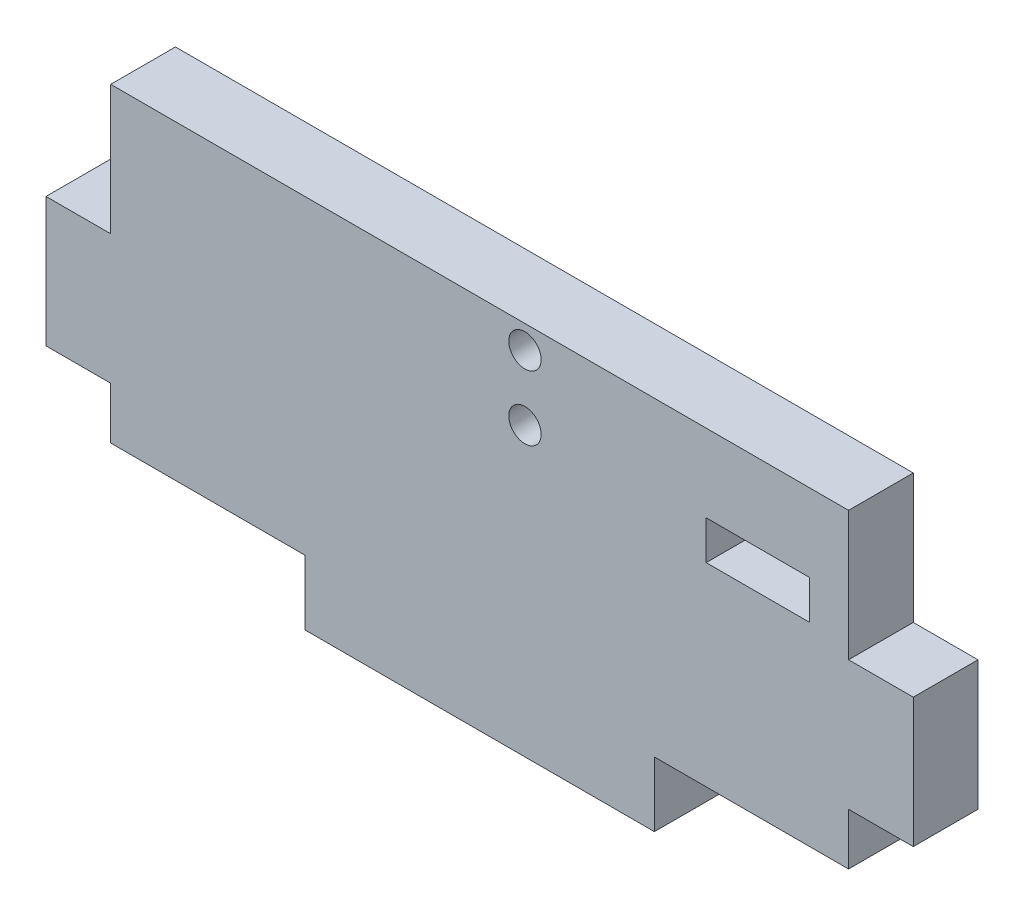
ISO-10303-21;
HEADER;
FILE_DESCRIPTION(('STEP AP214'),'2;1');
FILE_NAME('part.step','',(''),(''),'','','');
FILE_SCHEMA(('AUTOMOTIVE_DESIGN { 1 0 10303 214 1 1 1 1 }'));
ENDSEC;
DATA;
#1=APPLICATION_CONTEXT('core data for automotive mechanical design processes');
#2=APPLICATION_PROTOCOL_DEFINITION('international standard','automotive_design',2000,#1);
#3=PRODUCT_CONTEXT('',#1,'mechanical');
#4=PRODUCT('Part','Part','',(#3));
#5=PRODUCT_RELATED_PRODUCT_CATEGORY('part','',(#4));
#6=PRODUCT_DEFINITION_FORMATION('','',#4);
#7=PRODUCT_DEFINITION_CONTEXT('part definition',#1,'design');
#8=PRODUCT_DEFINITION('design','',#6,#7);
#9=PRODUCT_DEFINITION_SHAPE('','',#8);
#10=(LENGTH_UNIT() NAMED_UNIT(*) SI_UNIT(.MILLI.,.METRE.));
#11=(NAMED_UNIT(*) PLANE_ANGLE_UNIT() SI_UNIT($,.RADIAN.));
#12=(NAMED_UNIT(*) SI_UNIT($,.STERADIAN.) SOLID_ANGLE_UNIT());
#13=UNCERTAINTY_MEASURE_WITH_UNIT(LENGTH_MEASURE(1.E-05),#10,'distance_accuracy_value','');
#14=(GEOMETRIC_REPRESENTATION_CONTEXT(3) GLOBAL_UNCERTAINTY_ASSIGNED_CONTEXT((#13)) GLOBAL_UNIT_ASSIGNED_CONTEXT((#10,
#11,#12)) REPRESENTATION_CONTEXT('',''));
#15=CARTESIAN_POINT('',(0.,0.,0.));
#16=DIRECTION('',(0.,0.,1.));
#17=DIRECTION('',(1.,0.,0.));
#18=AXIS2_PLACEMENT_3D('',#15,#16,#17);
#19=CARTESIAN_POINT('',(0.,22.86,-26.3054205404025));
#20=DIRECTION('',(0.,-1.,0.));
#21=DIRECTION('',(1.,0.,0.));
#22=AXIS2_PLACEMENT_3D('',#19,#20,#21);
#23=PLANE('',#22);
#24=DIRECTION('',(-1.,0.,0.));
#25=VECTOR('',#24,1.);
#26=CARTESIAN_POINT('',(0.,22.86,-32.6554205404025));
#27=LINE('',#26,#25);
#28=CARTESIAN_POINT('',(68.58,22.86,-32.6554205404025));
#29=VERTEX_POINT('',#28);
#30=CARTESIAN_POINT('',(58.42,22.86,-32.6554205404025));
#31=VERTEX_POINT('',#30);
#32=EDGE_CURVE('E246',#29,#31,#27,.T.);
#33=ORIENTED_EDGE('',*,*,#32,.F.);
#34=DIRECTION('',(0.,0.,-1.));
#35=VECTOR('',#34,1.);
#36=CARTESIAN_POINT('',(68.58,22.86,-26.3054205404025));
#37=LINE('',#36,#35);
#38=CARTESIAN_POINT('',(68.58,22.86,-26.3054205404025));
#39=VERTEX_POINT('',#38);
#40=EDGE_CURVE('E11',#39,#29,#37,.T.);
#41=ORIENTED_EDGE('',*,*,#40,.F.);
#42=DIRECTION('',(-1.,0.,0.));
#43=VECTOR('',#42,1.);
#44=CARTESIAN_POINT('',(0.,22.86,-26.3054205404025));
#45=LINE('',#44,#43);
#46=CARTESIAN_POINT('',(58.42,22.86,-26.3054205404025));
#47=VERTEX_POINT('',#46);
#48=EDGE_CURVE('E195',#39,#47,#45,.T.);
#49=ORIENTED_EDGE('',*,*,#48,.T.);
#50=DIRECTION('',(0.,0.,-1.));
#51=VECTOR('',#50,1.);
#52=CARTESIAN_POINT('',(58.42,22.86,-26.3054205404025));
#53=LINE('',#52,#51);
#54=EDGE_CURVE('E192',#47,#31,#53,.T.);
#55=ORIENTED_EDGE('',*,*,#54,.T.);
#56=EDGE_LOOP('',(#33,#41,#49,#55));
#57=FACE_BOUND('',#56,.T.);
#58=ADVANCED_FACE('F32',(#57),#23,.T.);
#59=CARTESIAN_POINT('',(68.58,0.,-26.3054205404025));
#60=DIRECTION('',(1.,0.,0.));
#61=DIRECTION('',(0.,0.,-1.));
#62=AXIS2_PLACEMENT_3D('',#59,#60,#61);
#63=PLANE('',#62);
#64=DIRECTION('',(0.,-1.,0.));
#65=VECTOR('',#64,1.);
#66=CARTESIAN_POINT('',(68.58,0.,-32.6554205404025));
#67=LINE('',#66,#65);
#68=CARTESIAN_POINT('',(68.58,19.05,-32.6554205404025));
#69=VERTEX_POINT('',#68);
#70=EDGE_CURVE('E252',#29,#69,#67,.T.);
#71=ORIENTED_EDGE('',*,*,#70,.T.);
#72=DIRECTION('',(0.,0.,-1.));
#73=VECTOR('',#72,1.);
#74=CARTESIAN_POINT('',(68.58,19.05,-26.3054205404025));
#75=LINE('',#74,#73);
#76=CARTESIAN_POINT('',(68.58,19.05,-26.3054205404025));
#77=VERTEX_POINT('',#76);
#78=EDGE_CURVE('E42',#77,#69,#75,.T.);
#79=ORIENTED_EDGE('',*,*,#78,.F.);
#80=DIRECTION('',(0.,-1.,0.));
#81=VECTOR('',#80,1.);
#82=CARTESIAN_POINT('',(68.58,0.,-26.3054205404025));
#83=LINE('',#82,#81);
#84=EDGE_CURVE('E184',#39,#77,#83,.T.);
#85=ORIENTED_EDGE('',*,*,#84,.F.);
#86=ORIENTED_EDGE('',*,*,#40,.T.);
#87=EDGE_LOOP('',(#71,#79,#85,#86));
#88=FACE_BOUND('',#87,.T.);
#89=ADVANCED_FACE('F369',(#88),#63,.F.);
#90=CARTESIAN_POINT('',(0.,19.05,-26.3054205404025));
#91=DIRECTION('',(0.,-1.,0.));
#92=DIRECTION('',(0.,0.,-1.));
#93=AXIS2_PLACEMENT_3D('',#90,#91,#92);
#94=PLANE('',#93);
#95=DIRECTION('',(-1.,0.,0.));
#96=VECTOR('',#95,1.);
#97=CARTESIAN_POINT('',(0.,19.05,-32.6554205404025));
#98=LINE('',#97,#96);
#99=CARTESIAN_POINT('',(58.42,19.05,-32.6554205404025));
#100=VERTEX_POINT('',#99);
#101=EDGE_CURVE('E115',#69,#100,#98,.T.);
#102=ORIENTED_EDGE('',*,*,#101,.T.);
#103=DIRECTION('',(0.,0.,-1.));
#104=VECTOR('',#103,1.);
#105=CARTESIAN_POINT('',(58.42,19.05,-26.3054205404025));
#106=LINE('',#105,#104);
#107=CARTESIAN_POINT('',(58.42,19.05,-26.3054205404025));
#108=VERTEX_POINT('',#107);
#109=EDGE_CURVE('E188',#108,#100,#106,.T.);
#110=ORIENTED_EDGE('',*,*,#109,.F.);
#111=DIRECTION('',(-1.,0.,0.));
#112=VECTOR('',#111,1.);
#113=CARTESIAN_POINT('',(0.,19.05,-26.3054205404025));
#114=LINE('',#113,#112);
#115=EDGE_CURVE('E178',#77,#108,#114,.T.);
#116=ORIENTED_EDGE('',*,*,#115,.F.);
#117=ORIENTED_EDGE('',*,*,#78,.T.);
#118=EDGE_LOOP('',(#102,#110,#116,#117));
#119=FACE_BOUND('',#118,.T.);
#120=ADVANCED_FACE('F189',(#119),#94,.F.);
#121=CARTESIAN_POINT('',(0.,0.,-26.3054205404025));
#122=DIRECTION('',(1.,0.,0.));
#123=DIRECTION('',(0.,0.,-1.));
#124=AXIS2_PLACEMENT_3D('',#121,#122,#123);
#125=PLANE('',#124);
#126=DIRECTION('',(0.,-1.,0.));
#127=VECTOR('',#126,1.);
#128=CARTESIAN_POINT('',(0.,0.,-32.6554205404025));
#129=LINE('',#128,#127);
#130=CARTESIAN_POINT('',(0.,30.48,-32.6554205404025));
#131=VERTEX_POINT('',#130);
#132=CARTESIAN_POINT('',(0.,17.78,-32.6554205404025));
#133=VERTEX_POINT('',#132);
#134=EDGE_CURVE('E208',#131,#133,#129,.T.);
#135=ORIENTED_EDGE('',*,*,#134,.T.);
#136=DIRECTION('',(0.,0.,-1.));
#137=VECTOR('',#136,1.);
#138=CARTESIAN_POINT('',(0.,17.78,-26.3054205404025));
#139=LINE('',#138,#137);
#140=CARTESIAN_POINT('',(0.,17.78,-26.3054205404025));
#141=VERTEX_POINT('',#140);
#142=EDGE_CURVE('E257',#141,#133,#139,.T.);
#143=ORIENTED_EDGE('',*,*,#142,.F.);
#144=DIRECTION('',(0.,-1.,0.));
#145=VECTOR('',#144,1.);
#146=CARTESIAN_POINT('',(0.,0.,-26.3054205404025));
#147=LINE('',#146,#145);
#148=CARTESIAN_POINT('',(0.,30.48,-26.3054205404025));
#149=VERTEX_POINT('',#148);
#150=EDGE_CURVE('E297',#149,#141,#147,.T.);
#151=ORIENTED_EDGE('',*,*,#150,.F.);
#152=DIRECTION('',(0.,0.,-1.));
#153=VECTOR('',#152,1.);
#154=CARTESIAN_POINT('',(0.,30.48,-26.3054205404025));
#155=LINE('',#154,#153);
#156=EDGE_CURVE('E36',#149,#131,#155,.T.);
#157=ORIENTED_EDGE('',*,*,#156,.T.);
#158=EDGE_LOOP('',(#135,#143,#151,#157));
#159=FACE_BOUND('',#158,.T.);
#160=ADVANCED_FACE('F295',(#159),#125,.F.);
#161=CARTESIAN_POINT('',(0.,17.78,-26.3054205404025));
#162=DIRECTION('',(0.,1.,0.));
#163=DIRECTION('',(0.,0.,1.));
#164=AXIS2_PLACEMENT_3D('',#161,#162,#163);
#165=PLANE('',#164);
#166=DIRECTION('',(1.,0.,0.));
#167=VECTOR('',#166,1.);
#168=CARTESIAN_POINT('',(0.,17.78,-32.6554205404025));
#169=LINE('',#168,#167);
#170=CARTESIAN_POINT('',(-6.35,17.78,-32.6554205404025));
#171=VERTEX_POINT('',#170);
#172=EDGE_CURVE('E243',#171,#133,#169,.T.);
#173=ORIENTED_EDGE('',*,*,#172,.F.);
#174=DIRECTION('',(0.,0.,-1.));
#175=VECTOR('',#174,1.);
#176=CARTESIAN_POINT('',(-6.35,17.78,-26.3054205404025));
#177=LINE('',#176,#175);
#178=CARTESIAN_POINT('',(-6.35,17.78,-26.3054205404025));
#179=VERTEX_POINT('',#178);
#180=EDGE_CURVE('E259',#179,#171,#177,.T.);
#181=ORIENTED_EDGE('',*,*,#180,.F.);
#182=DIRECTION('',(1.,0.,0.));
#183=VECTOR('',#182,1.);
#184=CARTESIAN_POINT('',(0.,17.78,-26.3054205404025));
#185=LINE('',#184,#183);
#186=EDGE_CURVE('E197',#179,#141,#185,.T.);
#187=ORIENTED_EDGE('',*,*,#186,.T.);
#188=ORIENTED_EDGE('',*,*,#142,.T.);
#189=EDGE_LOOP('',(#173,#181,#187,#188));
#190=FACE_BOUND('',#189,.T.);
#191=ADVANCED_FACE('F305',(#190),#165,.T.);
#192=CARTESIAN_POINT('',(-6.35,0.,-26.3054205404025));
#193=DIRECTION('',(-1.,0.,0.));
#194=DIRECTION('',(0.,0.,1.));
#195=AXIS2_PLACEMENT_3D('',#192,#193,#194);
#196=PLANE('',#195);
#197=DIRECTION('',(0.,1.,0.));
#198=VECTOR('',#197,1.);
#199=CARTESIAN_POINT('',(-6.35,0.,-32.6554205404025));
#200=LINE('',#199,#198);
#201=CARTESIAN_POINT('',(-6.35,5.07999999999999,-32.6554205404025));
#202=VERTEX_POINT('',#201);
#203=EDGE_CURVE('E240',#202,#171,#200,.T.);
#204=ORIENTED_EDGE('',*,*,#203,.F.);
#205=DIRECTION('',(0.,0.,-1.));
#206=VECTOR('',#205,1.);
#207=CARTESIAN_POINT('',(-6.35,5.07999999999999,-26.3054205404025));
#208=LINE('',#207,#206);
#209=CARTESIAN_POINT('',(-6.35,5.07999999999999,-26.3054205404025));
#210=VERTEX_POINT('',#209);
#211=EDGE_CURVE('E261',#210,#202,#208,.T.);
#212=ORIENTED_EDGE('',*,*,#211,.F.);
#213=DIRECTION('',(0.,1.,0.));
#214=VECTOR('',#213,1.);
#215=CARTESIAN_POINT('',(-6.35,0.,-26.3054205404025));
#216=LINE('',#215,#214);
#217=EDGE_CURVE('E310',#210,#179,#216,.T.);
#218=ORIENTED_EDGE('',*,*,#217,.T.);
#219=ORIENTED_EDGE('',*,*,#180,.T.);
#220=EDGE_LOOP('',(#204,#212,#218,#219));
#221=FACE_BOUND('',#220,.T.);
#222=ADVANCED_FACE('F380',(#221),#196,.T.);
#223=CARTESIAN_POINT('',(0.,5.07999999999999,-26.3054205404025));
#224=DIRECTION('',(0.,1.,0.));
#225=DIRECTION('',(-1.,0.,0.));
#226=AXIS2_PLACEMENT_3D('',#223,#224,#225);
#227=PLANE('',#226);
#228=DIRECTION('',(1.,0.,0.));
#229=VECTOR('',#228,1.);
#230=CARTESIAN_POINT('',(0.,5.07999999999999,-32.6554205404025));
#231=LINE('',#230,#229);
#232=CARTESIAN_POINT('',(0.,5.07999999999999,-32.6554205404025));
#233=VERTEX_POINT('',#232);
#234=EDGE_CURVE('E238',#202,#233,#231,.T.);
#235=ORIENTED_EDGE('',*,*,#234,.T.);
#236=DIRECTION('',(0.,0.,-1.));
#237=VECTOR('',#236,1.);
#238=CARTESIAN_POINT('',(0.,5.07999999999999,-26.3054205404025));
#239=LINE('',#238,#237);
#240=CARTESIAN_POINT('',(0.,5.07999999999999,-26.3054205404025));
#241=VERTEX_POINT('',#240);
#242=EDGE_CURVE('E263',#241,#233,#239,.T.);
#243=ORIENTED_EDGE('',*,*,#242,.F.);
#244=DIRECTION('',(1.,0.,0.));
#245=VECTOR('',#244,1.);
#246=CARTESIAN_POINT('',(0.,5.07999999999999,-26.3054205404025));
#247=LINE('',#246,#245);
#248=EDGE_CURVE('E311',#210,#241,#247,.T.);
#249=ORIENTED_EDGE('',*,*,#248,.F.);
#250=ORIENTED_EDGE('',*,*,#211,.T.);
#251=EDGE_LOOP('',(#235,#243,#249,#250));
#252=FACE_BOUND('',#251,.T.);
#253=ADVANCED_FACE('F383',(#252),#227,.F.);
#254=CARTESIAN_POINT('',(0.,0.,-32.6554205404025));
#255=VERTEX_POINT('',#254);
#256=EDGE_CURVE('E212',#233,#255,#129,.T.);
#257=ORIENTED_EDGE('',*,*,#256,.T.);
#258=DIRECTION('',(0.,0.,-1.));
#259=VECTOR('',#258,1.);
#260=CARTESIAN_POINT('',(0.,0.,-26.3054205404025));
#261=LINE('',#260,#259);
#262=CARTESIAN_POINT('',(0.,0.,-26.3054205404025));
#263=VERTEX_POINT('',#262);
#264=EDGE_CURVE('E266',#263,#255,#261,.T.);
#265=ORIENTED_EDGE('',*,*,#264,.F.);
#266=EDGE_CURVE('E315',#241,#263,#147,.T.);
#267=ORIENTED_EDGE('',*,*,#266,.F.);
#268=ORIENTED_EDGE('',*,*,#242,.T.);
#269=EDGE_LOOP('',(#257,#265,#267,#268));
#270=FACE_BOUND('',#269,.T.);
#271=ADVANCED_FACE('F387',(#270),#125,.F.);
#272=CARTESIAN_POINT('',(0.,0.,-26.3054205404025));
#273=DIRECTION('',(0.,-1.,0.));
#274=DIRECTION('',(0.,0.,-1.));
#275=AXIS2_PLACEMENT_3D('',#272,#273,#274);
#276=PLANE('',#275);
#277=DIRECTION('',(-1.,0.,0.));
#278=VECTOR('',#277,1.);
#279=CARTESIAN_POINT('',(0.,0.,-32.6554205404025));
#280=LINE('',#279,#278);
#281=CARTESIAN_POINT('',(19.05,0.,-32.6554205404025));
#282=VERTEX_POINT('',#281);
#283=EDGE_CURVE('E229',#282,#255,#280,.T.);
#284=ORIENTED_EDGE('',*,*,#283,.F.);
#285=DIRECTION('',(0.,0.,-1.));
#286=VECTOR('',#285,1.);
#287=CARTESIAN_POINT('',(19.05,0.,-26.3054205404025));
#288=LINE('',#287,#286);
#289=CARTESIAN_POINT('',(19.05,0.,-26.3054205404025));
#290=VERTEX_POINT('',#289);
#291=EDGE_CURVE('E268',#290,#282,#288,.T.);
#292=ORIENTED_EDGE('',*,*,#291,.F.);
#293=DIRECTION('',(-1.,0.,0.));
#294=VECTOR('',#293,1.);
#295=CARTESIAN_POINT('',(0.,0.,-26.3054205404025));
#296=LINE('',#295,#294);
#297=EDGE_CURVE('E318',#290,#263,#296,.T.);
#298=ORIENTED_EDGE('',*,*,#297,.T.);
#299=ORIENTED_EDGE('',*,*,#264,.T.);
#300=EDGE_LOOP('',(#284,#292,#298,#299));
#301=FACE_BOUND('',#300,.T.);
#302=ADVANCED_FACE('F391',(#301),#276,.T.);
#303=CARTESIAN_POINT('',(19.05,0.,-26.3054205404025));
#304=DIRECTION('',(1.,0.,0.));
#305=DIRECTION('',(0.,0.,-1.));
#306=AXIS2_PLACEMENT_3D('',#303,#304,#305);
#307=PLANE('',#306);
#308=DIRECTION('',(0.,-1.,0.));
#309=VECTOR('',#308,1.);
#310=CARTESIAN_POINT('',(19.05,0.,-32.6554205404025));
#311=LINE('',#310,#309);
#312=CARTESIAN_POINT('',(19.05,-6.35,-32.6554205404025));
#313=VERTEX_POINT('',#312);
#314=EDGE_CURVE('E235',#282,#313,#311,.T.);
#315=ORIENTED_EDGE('',*,*,#314,.T.);
#316=DIRECTION('',(0.,0.,-1.));
#317=VECTOR('',#316,1.);
#318=CARTESIAN_POINT('',(19.05,-6.35,-26.3054205404025));
#319=LINE('',#318,#317);
#320=CARTESIAN_POINT('',(19.05,-6.35,-26.3054205404025));
#321=VERTEX_POINT('',#320);
#322=EDGE_CURVE('E270',#321,#313,#319,.T.);
#323=ORIENTED_EDGE('',*,*,#322,.F.);
#324=DIRECTION('',(0.,-1.,0.));
#325=VECTOR('',#324,1.);
#326=CARTESIAN_POINT('',(19.05,0.,-26.3054205404025));
#327=LINE('',#326,#325);
#328=EDGE_CURVE('E316',#290,#321,#327,.T.);
#329=ORIENTED_EDGE('',*,*,#328,.F.);
#330=ORIENTED_EDGE('',*,*,#291,.T.);
#331=EDGE_LOOP('',(#315,#323,#329,#330));
#332=FACE_BOUND('',#331,.T.);
#333=ADVANCED_FACE('F395',(#332),#307,.F.);
#334=CARTESIAN_POINT('',(0.,-6.35,-26.3054205404025));
#335=DIRECTION('',(0.,-1.,0.));
#336=DIRECTION('',(0.,0.,-1.));
#337=AXIS2_PLACEMENT_3D('',#334,#335,#336);
#338=PLANE('',#337);
#339=DIRECTION('',(-1.,0.,0.));
#340=VECTOR('',#339,1.);
#341=CARTESIAN_POINT('',(0.,-6.35,-32.6554205404025));
#342=LINE('',#341,#340);
#343=CARTESIAN_POINT('',(53.34,-6.35,-32.6554205404025));
#344=VERTEX_POINT('',#343);
#345=EDGE_CURVE('E232',#344,#313,#342,.T.);
#346=ORIENTED_EDGE('',*,*,#345,.F.);
#347=DIRECTION('',(0.,0.,-1.));
#348=VECTOR('',#347,1.);
#349=CARTESIAN_POINT('',(53.34,-6.35,-26.3054205404025));
#350=LINE('',#349,#348);
#351=CARTESIAN_POINT('',(53.34,-6.35,-26.3054205404025));
#352=VERTEX_POINT('',#351);
#353=EDGE_CURVE('E272',#352,#344,#350,.T.);
#354=ORIENTED_EDGE('',*,*,#353,.F.);
#355=DIRECTION('',(-1.,0.,0.));
#356=VECTOR('',#355,1.);
#357=CARTESIAN_POINT('',(0.,-6.35,-26.3054205404025));
#358=LINE('',#357,#356);
#359=EDGE_CURVE('E319',#352,#321,#358,.T.);
#360=ORIENTED_EDGE('',*,*,#359,.T.);
#361=ORIENTED_EDGE('',*,*,#322,.T.);
#362=EDGE_LOOP('',(#346,#354,#360,#361));
#363=FACE_BOUND('',#362,.T.);
#364=ADVANCED_FACE('F400',(#363),#338,.T.);
#365=CARTESIAN_POINT('',(53.34,0.,-26.3054205404025));
#366=DIRECTION('',(1.,0.,0.));
#367=DIRECTION('',(0.,0.,-1.));
#368=AXIS2_PLACEMENT_3D('',#365,#366,#367);
#369=PLANE('',#368);
#370=DIRECTION('',(0.,-1.,0.));
#371=VECTOR('',#370,1.);
#372=CARTESIAN_POINT('',(53.34,0.,-32.6554205404025));
#373=LINE('',#372,#371);
#374=CARTESIAN_POINT('',(53.34,0.,-32.6554205404025));
#375=VERTEX_POINT('',#374);
#376=EDGE_CURVE('E228',#375,#344,#373,.T.);
#377=ORIENTED_EDGE('',*,*,#376,.F.);
#378=DIRECTION('',(0.,0.,-1.));
#379=VECTOR('',#378,1.);
#380=CARTESIAN_POINT('',(53.34,0.,-26.3054205404025));
#381=LINE('',#380,#379);
#382=CARTESIAN_POINT('',(53.34,0.,-26.3054205404025));
#383=VERTEX_POINT('',#382);
#384=EDGE_CURVE('E274',#383,#375,#381,.T.);
#385=ORIENTED_EDGE('',*,*,#384,.F.);
#386=DIRECTION('',(0.,-1.,0.));
#387=VECTOR('',#386,1.);
#388=CARTESIAN_POINT('',(53.34,0.,-26.3054205404025));
#389=LINE('',#388,#387);
#390=EDGE_CURVE('E322',#383,#352,#389,.T.);
#391=ORIENTED_EDGE('',*,*,#390,.T.);
#392=ORIENTED_EDGE('',*,*,#353,.T.);
#393=EDGE_LOOP('',(#377,#385,#391,#392));
#394=FACE_BOUND('',#393,.T.);
#395=ADVANCED_FACE('F404',(#394),#369,.T.);
#396=CARTESIAN_POINT('',(72.39,0.,-32.6554205404025));
#397=VERTEX_POINT('',#396);
#398=EDGE_CURVE('E225',#397,#375,#280,.T.);
#399=ORIENTED_EDGE('',*,*,#398,.F.);
#400=DIRECTION('',(0.,0.,-1.));
#401=VECTOR('',#400,1.);
#402=CARTESIAN_POINT('',(72.39,0.,-26.3054205404025));
#403=LINE('',#402,#401);
#404=CARTESIAN_POINT('',(72.39,0.,-26.3054205404025));
#405=VERTEX_POINT('',#404);
#406=EDGE_CURVE('E276',#405,#397,#403,.T.);
#407=ORIENTED_EDGE('',*,*,#406,.F.);
#408=EDGE_CURVE('E325',#405,#383,#296,.T.);
#409=ORIENTED_EDGE('',*,*,#408,.T.);
#410=ORIENTED_EDGE('',*,*,#384,.T.);
#411=EDGE_LOOP('',(#399,#407,#409,#410));
#412=FACE_BOUND('',#411,.T.);
#413=ADVANCED_FACE('F397',(#412),#276,.T.);
#414=CARTESIAN_POINT('',(72.39,0.,-26.3054205404025));
#415=DIRECTION('',(-1.,0.,0.));
#416=DIRECTION('',(0.,0.,1.));
#417=AXIS2_PLACEMENT_3D('',#414,#415,#416);
#418=PLANE('',#417);
#419=DIRECTION('',(0.,1.,0.));
#420=VECTOR('',#419,1.);
#421=CARTESIAN_POINT('',(72.39,0.,-32.6554205404025));
#422=LINE('',#421,#420);
#423=CARTESIAN_POINT('',(72.39,5.08,-32.6554205404025));
#424=VERTEX_POINT('',#423);
#425=EDGE_CURVE('E217',#397,#424,#422,.T.);
#426=ORIENTED_EDGE('',*,*,#425,.T.);
#427=DIRECTION('',(0.,0.,-1.));
#428=VECTOR('',#427,1.);
#429=CARTESIAN_POINT('',(72.39,5.08,-26.3054205404025));
#430=LINE('',#429,#428);
#431=CARTESIAN_POINT('',(72.39,5.08,-26.3054205404025));
#432=VERTEX_POINT('',#431);
#433=EDGE_CURVE('E278',#432,#424,#430,.T.);
#434=ORIENTED_EDGE('',*,*,#433,.F.);
#435=DIRECTION('',(0.,1.,0.));
#436=VECTOR('',#435,1.);
#437=CARTESIAN_POINT('',(72.39,0.,-26.3054205404025));
#438=LINE('',#437,#436);
#439=EDGE_CURVE('E328',#405,#432,#438,.T.);
#440=ORIENTED_EDGE('',*,*,#439,.F.);
#441=ORIENTED_EDGE('',*,*,#406,.T.);
#442=EDGE_LOOP('',(#426,#434,#440,#441));
#443=FACE_BOUND('',#442,.T.);
#444=ADVANCED_FACE('F409',(#443),#418,.F.);
#445=CARTESIAN_POINT('',(0.,5.08,-26.3054205404025));
#446=DIRECTION('',(0.,-1.,0.));
#447=DIRECTION('',(0.,0.,-1.));
#448=AXIS2_PLACEMENT_3D('',#445,#446,#447);
#449=PLANE('',#448);
#450=DIRECTION('',(-1.,0.,0.));
#451=VECTOR('',#450,1.);
#452=CARTESIAN_POINT('',(0.,5.08,-32.6554205404025));
#453=LINE('',#452,#451);
#454=CARTESIAN_POINT('',(78.74,5.08,-32.6554205404025));
#455=VERTEX_POINT('',#454);
#456=EDGE_CURVE('E222',#455,#424,#453,.T.);
#457=ORIENTED_EDGE('',*,*,#456,.F.);
#458=DIRECTION('',(0.,0.,-1.));
#459=VECTOR('',#458,1.);
#460=CARTESIAN_POINT('',(78.74,5.08,-26.3054205404025));
#461=LINE('',#460,#459);
#462=CARTESIAN_POINT('',(78.74,5.08,-26.3054205404025));
#463=VERTEX_POINT('',#462);
#464=EDGE_CURVE('E280',#463,#455,#461,.T.);
#465=ORIENTED_EDGE('',*,*,#464,.F.);
#466=DIRECTION('',(-1.,0.,0.));
#467=VECTOR('',#466,1.);
#468=CARTESIAN_POINT('',(0.,5.08,-26.3054205404025));
#469=LINE('',#468,#467);
#470=EDGE_CURVE('E329',#463,#432,#469,.T.);
#471=ORIENTED_EDGE('',*,*,#470,.T.);
#472=ORIENTED_EDGE('',*,*,#433,.T.);
#473=EDGE_LOOP('',(#457,#465,#471,#472));
#474=FACE_BOUND('',#473,.T.);
#475=ADVANCED_FACE('F412',(#474),#449,.T.);
#476=CARTESIAN_POINT('',(78.74,0.,-26.3054205404025));
#477=DIRECTION('',(1.,0.,0.));
#478=DIRECTION('',(0.,0.,-1.));
#479=AXIS2_PLACEMENT_3D('',#476,#477,#478);
#480=PLANE('',#479);
#481=DIRECTION('',(0.,-1.,0.));
#482=VECTOR('',#481,1.);
#483=CARTESIAN_POINT('',(78.74,0.,-32.6554205404025));
#484=LINE('',#483,#482);
#485=CARTESIAN_POINT('',(78.74,17.78,-32.6554205404025));
#486=VERTEX_POINT('',#485);
#487=EDGE_CURVE('E219',#486,#455,#484,.T.);
#488=ORIENTED_EDGE('',*,*,#487,.F.);
#489=DIRECTION('',(0.,0.,-1.));
#490=VECTOR('',#489,1.);
#491=CARTESIAN_POINT('',(78.74,17.78,-26.3054205404025));
#492=LINE('',#491,#490);
#493=CARTESIAN_POINT('',(78.74,17.78,-26.3054205404025));
#494=VERTEX_POINT('',#493);
#495=EDGE_CURVE('E282',#494,#486,#492,.T.);
#496=ORIENTED_EDGE('',*,*,#495,.F.);
#497=DIRECTION('',(0.,-1.,0.));
#498=VECTOR('',#497,1.);
#499=CARTESIAN_POINT('',(78.74,0.,-26.3054205404025));
#500=LINE('',#499,#498);
#501=EDGE_CURVE('E332',#494,#463,#500,.T.);
#502=ORIENTED_EDGE('',*,*,#501,.T.);
#503=ORIENTED_EDGE('',*,*,#464,.T.);
#504=EDGE_LOOP('',(#488,#496,#502,#503));
#505=FACE_BOUND('',#504,.T.);
#506=ADVANCED_FACE('F416',(#505),#480,.T.);
#507=CARTESIAN_POINT('',(0.,17.78,-26.3054205404025));
#508=DIRECTION('',(0.,-1.,0.));
#509=DIRECTION('',(1.,0.,0.));
#510=AXIS2_PLACEMENT_3D('',#507,#508,#509);
#511=PLANE('',#510);
#512=DIRECTION('',(-1.,0.,0.));
#513=VECTOR('',#512,1.);
#514=CARTESIAN_POINT('',(0.,17.78,-32.6554205404025));
#515=LINE('',#514,#513);
#516=CARTESIAN_POINT('',(72.39,17.78,-32.6554205404025));
#517=VERTEX_POINT('',#516);
#518=EDGE_CURVE('E216',#486,#517,#515,.T.);
#519=ORIENTED_EDGE('',*,*,#518,.T.);
#520=DIRECTION('',(0.,0.,-1.));
#521=VECTOR('',#520,1.);
#522=CARTESIAN_POINT('',(72.39,17.78,-26.3054205404025));
#523=LINE('',#522,#521);
#524=CARTESIAN_POINT('',(72.39,17.78,-26.3054205404025));
#525=VERTEX_POINT('',#524);
#526=EDGE_CURVE('E284',#525,#517,#523,.T.);
#527=ORIENTED_EDGE('',*,*,#526,.F.);
#528=DIRECTION('',(-1.,0.,0.));
#529=VECTOR('',#528,1.);
#530=CARTESIAN_POINT('',(0.,17.78,-26.3054205404025));
#531=LINE('',#530,#529);
#532=EDGE_CURVE('E335',#494,#525,#531,.T.);
#533=ORIENTED_EDGE('',*,*,#532,.F.);
#534=ORIENTED_EDGE('',*,*,#495,.T.);
#535=EDGE_LOOP('',(#519,#527,#533,#534));
#536=FACE_BOUND('',#535,.T.);
#537=ADVANCED_FACE('F420',(#536),#511,.F.);
#538=CARTESIAN_POINT('',(72.39,30.48,-32.6554205404025));
#539=VERTEX_POINT('',#538);
#540=EDGE_CURVE('E214',#517,#539,#422,.T.);
#541=ORIENTED_EDGE('',*,*,#540,.T.);
#542=DIRECTION('',(0.,0.,-1.));
#543=VECTOR('',#542,1.);
#544=CARTESIAN_POINT('',(72.39,30.48,-26.3054205404025));
#545=LINE('',#544,#543);
#546=CARTESIAN_POINT('',(72.39,30.48,-26.3054205404025));
#547=VERTEX_POINT('',#546);
#548=EDGE_CURVE('E286',#547,#539,#545,.T.);
#549=ORIENTED_EDGE('',*,*,#548,.F.);
#550=EDGE_CURVE('E337',#525,#547,#438,.T.);
#551=ORIENTED_EDGE('',*,*,#550,.F.);
#552=ORIENTED_EDGE('',*,*,#526,.T.);
#553=EDGE_LOOP('',(#541,#549,#551,#552));
#554=FACE_BOUND('',#553,.T.);
#555=ADVANCED_FACE('F365',(#554),#418,.F.);
#556=CARTESIAN_POINT('',(0.,30.48,-26.3054205404025));
#557=DIRECTION('',(0.,-1.,0.));
#558=DIRECTION('',(0.,0.,-1.));
#559=AXIS2_PLACEMENT_3D('',#556,#557,#558);
#560=PLANE('',#559);
#561=DIRECTION('',(-1.,0.,0.));
#562=VECTOR('',#561,1.);
#563=CARTESIAN_POINT('',(0.,30.48,-32.6554205404025));
#564=LINE('',#563,#562);
#565=EDGE_CURVE('E211',#539,#131,#564,.T.);
#566=ORIENTED_EDGE('',*,*,#565,.T.);
#567=ORIENTED_EDGE('',*,*,#156,.F.);
#568=DIRECTION('',(-1.,0.,0.));
#569=VECTOR('',#568,1.);
#570=CARTESIAN_POINT('',(0.,30.48,-26.3054205404025));
#571=LINE('',#570,#569);
#572=EDGE_CURVE('E127',#547,#149,#571,.T.);
#573=ORIENTED_EDGE('',*,*,#572,.F.);
#574=ORIENTED_EDGE('',*,*,#548,.T.);
#575=EDGE_LOOP('',(#566,#567,#573,#574));
#576=FACE_BOUND('',#575,.T.);
#577=ADVANCED_FACE('F360',(#576),#560,.F.);
#578=CARTESIAN_POINT('',(40.64,28.194,-26.3054205404025));
#579=DIRECTION('',(0.,0.,-1.));
#580=DIRECTION('',(-1.,0.,0.));
#581=AXIS2_PLACEMENT_3D('',#578,#579,#580);
#582=CYLINDRICAL_SURFACE('',#581,1.5875);
#583=CARTESIAN_POINT('',(40.64,28.194,-26.3054205404025));
#584=DIRECTION('',(0.,0.,-1.));
#585=DIRECTION('',(-1.,0.,0.));
#586=AXIS2_PLACEMENT_3D('',#583,#584,#585);
#587=CIRCLE('',#586,1.5875);
#588=CARTESIAN_POINT('',(39.0525,28.194,-26.3054205404025));
#589=VERTEX_POINT('',#588);
#590=EDGE_CURVE('E341',#589,#589,#587,.T.);
#591=ORIENTED_EDGE('',*,*,#590,.F.);
#592=EDGE_LOOP('',(#591));
#593=FACE_BOUND('',#592,.T.);
#594=CARTESIAN_POINT('',(40.64,28.194,-32.6554205404025));
#595=DIRECTION('',(0.,0.,-1.));
#596=DIRECTION('',(-1.,0.,0.));
#597=AXIS2_PLACEMENT_3D('',#594,#595,#596);
#598=CIRCLE('',#597,1.5875);
#599=CARTESIAN_POINT('',(39.0525,28.194,-32.6554205404025));
#600=VERTEX_POINT('',#599);
#601=EDGE_CURVE('E205',#600,#600,#598,.T.);
#602=ORIENTED_EDGE('',*,*,#601,.T.);
#603=EDGE_LOOP('',(#602));
#604=FACE_BOUND('',#603,.T.);
#605=ADVANCED_FACE('F351',(#593,#604),#582,.F.);
#606=CARTESIAN_POINT('',(40.64,21.844,-26.3054205404025));
#607=DIRECTION('',(0.,0.,-1.));
#608=DIRECTION('',(-1.,0.,0.));
#609=AXIS2_PLACEMENT_3D('',#606,#607,#608);
#610=CYLINDRICAL_SURFACE('',#609,1.5875);
#611=CARTESIAN_POINT('',(40.64,21.844,-26.3054205404025));
#612=DIRECTION('',(0.,0.,-1.));
#613=DIRECTION('',(-1.,0.,0.));
#614=AXIS2_PLACEMENT_3D('',#611,#612,#613);
#615=CIRCLE('',#614,1.5875);
#616=CARTESIAN_POINT('',(39.0525,21.844,-26.3054205404025));
#617=VERTEX_POINT('',#616);
#618=EDGE_CURVE('E253',#617,#617,#615,.T.);
#619=ORIENTED_EDGE('',*,*,#618,.F.);
#620=EDGE_LOOP('',(#619));
#621=FACE_BOUND('',#620,.T.);
#622=CARTESIAN_POINT('',(40.64,21.844,-32.6554205404025));
#623=DIRECTION('',(0.,0.,-1.));
#624=DIRECTION('',(-1.,0.,0.));
#625=AXIS2_PLACEMENT_3D('',#622,#623,#624);
#626=CIRCLE('',#625,1.5875);
#627=CARTESIAN_POINT('',(39.0525,21.844,-32.6554205404025));
#628=VERTEX_POINT('',#627);
#629=EDGE_CURVE('E202',#628,#628,#626,.T.);
#630=ORIENTED_EDGE('',*,*,#629,.T.);
#631=EDGE_LOOP('',(#630));
#632=FACE_BOUND('',#631,.T.);
#633=ADVANCED_FACE('F34',(#621,#632),#610,.F.);
#634=CARTESIAN_POINT('',(58.42,0.,-26.3054205404025));
#635=DIRECTION('',(1.,0.,0.));
#636=DIRECTION('',(0.,0.,-1.));
#637=AXIS2_PLACEMENT_3D('',#634,#635,#636);
#638=PLANE('',#637);
#639=DIRECTION('',(0.,-1.,0.));
#640=VECTOR('',#639,1.);
#641=CARTESIAN_POINT('',(58.42,0.,-32.6554205404025));
#642=LINE('',#641,#640);
#643=EDGE_CURVE('E249',#31,#100,#642,.T.);
#644=ORIENTED_EDGE('',*,*,#643,.F.);
#645=ORIENTED_EDGE('',*,*,#54,.F.);
#646=DIRECTION('',(0.,-1.,0.));
#647=VECTOR('',#646,1.);
#648=CARTESIAN_POINT('',(58.42,0.,-26.3054205404025));
#649=LINE('',#648,#647);
#650=EDGE_CURVE('E183',#47,#108,#649,.T.);
#651=ORIENTED_EDGE('',*,*,#650,.T.);
#652=ORIENTED_EDGE('',*,*,#109,.T.);
#653=EDGE_LOOP('',(#644,#645,#651,#652));
#654=FACE_BOUND('',#653,.T.);
#655=ADVANCED_FACE('F194',(#654),#638,.T.);
#656=CARTESIAN_POINT('',(0.,0.,-26.3054205404025));
#657=DIRECTION('',(0.,0.,-1.));
#658=DIRECTION('',(-1.,0.,0.));
#659=AXIS2_PLACEMENT_3D('',#656,#657,#658);
#660=PLANE('',#659);
#661=ORIENTED_EDGE('',*,*,#618,.T.);
#662=EDGE_LOOP('',(#661));
#663=FACE_BOUND('',#662,.T.);
#664=ORIENTED_EDGE('',*,*,#590,.T.);
#665=EDGE_LOOP('',(#664));
#666=FACE_BOUND('',#665,.T.);
#667=ORIENTED_EDGE('',*,*,#150,.T.);
#668=ORIENTED_EDGE('',*,*,#186,.F.);
#669=ORIENTED_EDGE('',*,*,#217,.F.);
#670=ORIENTED_EDGE('',*,*,#248,.T.);
#671=ORIENTED_EDGE('',*,*,#266,.T.);
#672=ORIENTED_EDGE('',*,*,#297,.F.);
#673=ORIENTED_EDGE('',*,*,#328,.T.);
#674=ORIENTED_EDGE('',*,*,#359,.F.);
#675=ORIENTED_EDGE('',*,*,#390,.F.);
#676=ORIENTED_EDGE('',*,*,#408,.F.);
#677=ORIENTED_EDGE('',*,*,#439,.T.);
#678=ORIENTED_EDGE('',*,*,#470,.F.);
#679=ORIENTED_EDGE('',*,*,#501,.F.);
#680=ORIENTED_EDGE('',*,*,#532,.T.);
#681=ORIENTED_EDGE('',*,*,#550,.T.);
#682=ORIENTED_EDGE('',*,*,#572,.T.);
#683=EDGE_LOOP('',(#667,#668,#669,#670,#671,#672,#673,#674,#675,#676,#677,#678,#679,#680,#681,#682));
#684=FACE_BOUND('',#683,.T.);
#685=ORIENTED_EDGE('',*,*,#48,.F.);
#686=ORIENTED_EDGE('',*,*,#84,.T.);
#687=ORIENTED_EDGE('',*,*,#115,.T.);
#688=ORIENTED_EDGE('',*,*,#650,.F.);
#689=EDGE_LOOP('',(#685,#686,#687,#688));
#690=FACE_BOUND('',#689,.T.);
#691=ADVANCED_FACE('F181',(#663,#666,#684,#690),#660,.F.);
#692=CARTESIAN_POINT('',(0.,0.,-32.6554205404025));
#693=DIRECTION('',(0.,0.,-1.));
#694=DIRECTION('',(-1.,0.,0.));
#695=AXIS2_PLACEMENT_3D('',#692,#693,#694);
#696=PLANE('',#695);
#697=ORIENTED_EDGE('',*,*,#629,.F.);
#698=EDGE_LOOP('',(#697));
#699=FACE_BOUND('',#698,.T.);
#700=ORIENTED_EDGE('',*,*,#601,.F.);
#701=EDGE_LOOP('',(#700));
#702=FACE_BOUND('',#701,.T.);
#703=ORIENTED_EDGE('',*,*,#134,.F.);
#704=ORIENTED_EDGE('',*,*,#565,.F.);
#705=ORIENTED_EDGE('',*,*,#540,.F.);
#706=ORIENTED_EDGE('',*,*,#518,.F.);
#707=ORIENTED_EDGE('',*,*,#487,.T.);
#708=ORIENTED_EDGE('',*,*,#456,.T.);
#709=ORIENTED_EDGE('',*,*,#425,.F.);
#710=ORIENTED_EDGE('',*,*,#398,.T.);
#711=ORIENTED_EDGE('',*,*,#376,.T.);
#712=ORIENTED_EDGE('',*,*,#345,.T.);
#713=ORIENTED_EDGE('',*,*,#314,.F.);
#714=ORIENTED_EDGE('',*,*,#283,.T.);
#715=ORIENTED_EDGE('',*,*,#256,.F.);
#716=ORIENTED_EDGE('',*,*,#234,.F.);
#717=ORIENTED_EDGE('',*,*,#203,.T.);
#718=ORIENTED_EDGE('',*,*,#172,.T.);
#719=EDGE_LOOP('',(#703,#704,#705,#706,#707,#708,#709,#710,#711,#712,#713,#714,#715,#716,#717,#718));
#720=FACE_BOUND('',#719,.T.);
#721=ORIENTED_EDGE('',*,*,#32,.T.);
#722=ORIENTED_EDGE('',*,*,#643,.T.);
#723=ORIENTED_EDGE('',*,*,#101,.F.);
#724=ORIENTED_EDGE('',*,*,#70,.F.);
#725=EDGE_LOOP('',(#721,#722,#723,#724));
#726=FACE_BOUND('',#725,.T.);
#727=ADVANCED_FACE('F299',(#699,#702,#720,#726),#696,.T.);
#728=CLOSED_SHELL('',(#58,#89,#120,#160,#191,#222,#253,#271,#302,#333,#364,#395,#413,#444,#475,
#506,#537,#555,#577,#605,#633,#655,#691,#727));
#729=MANIFOLD_SOLID_BREP('B2',#728);
#730=ADVANCED_BREP_SHAPE_REPRESENTATION('',(#18,#729),#14);
#731=SHAPE_DEFINITION_REPRESENTATION(#9,#730);
ENDSEC;
END-ISO-10303-21;
